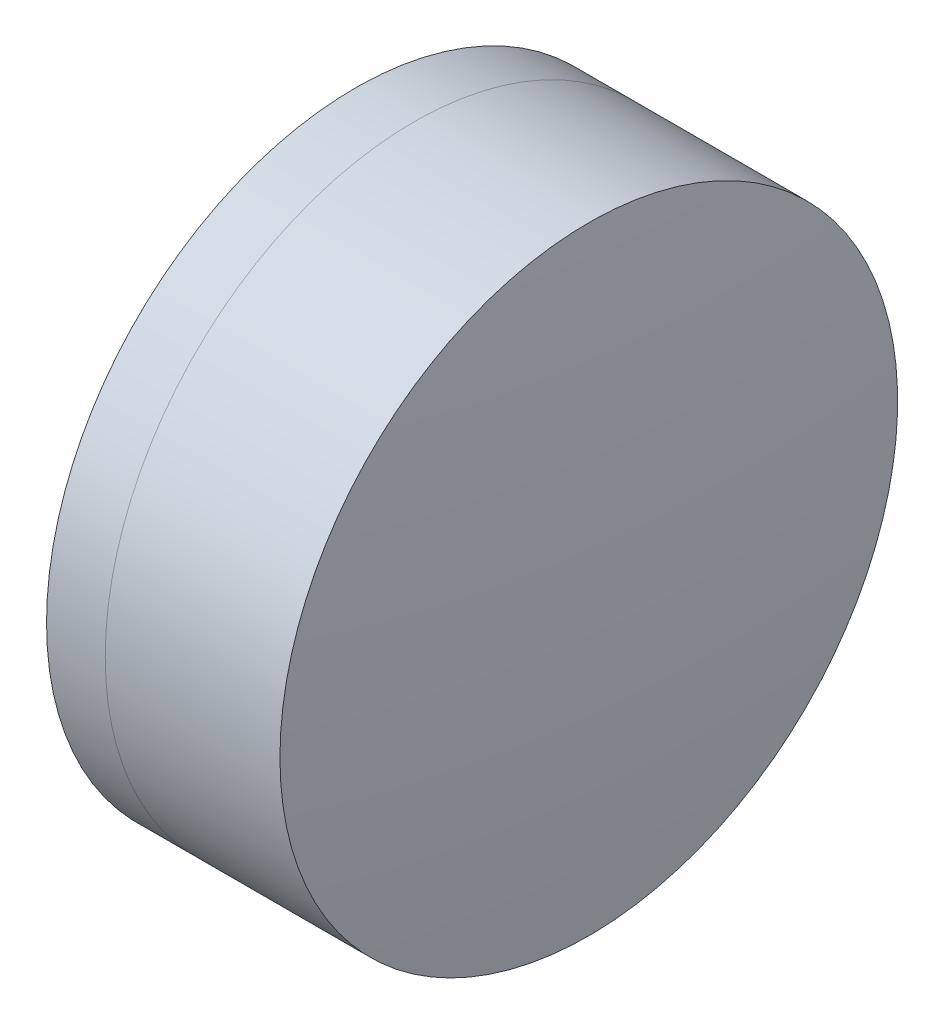
ISO-10303-21;
HEADER;
FILE_DESCRIPTION(('STEP AP214'),'2;1');
FILE_NAME('part.step','',(''),(''),'','','');
FILE_SCHEMA(('AUTOMOTIVE_DESIGN { 1 0 10303 214 1 1 1 1 }'));
ENDSEC;
DATA;
#1=APPLICATION_CONTEXT('core data for automotive mechanical design processes');
#2=APPLICATION_PROTOCOL_DEFINITION('international standard','automotive_design',2000,#1);
#3=PRODUCT_CONTEXT('',#1,'mechanical');
#4=PRODUCT('Part','Part','',(#3));
#5=PRODUCT_RELATED_PRODUCT_CATEGORY('part','',(#4));
#6=PRODUCT_DEFINITION_FORMATION('','',#4);
#7=PRODUCT_DEFINITION_CONTEXT('part definition',#1,'design');
#8=PRODUCT_DEFINITION('design','',#6,#7);
#9=PRODUCT_DEFINITION_SHAPE('','',#8);
#10=(LENGTH_UNIT() NAMED_UNIT(*) SI_UNIT(.MILLI.,.METRE.));
#11=(NAMED_UNIT(*) PLANE_ANGLE_UNIT() SI_UNIT($,.RADIAN.));
#12=(NAMED_UNIT(*) SI_UNIT($,.STERADIAN.) SOLID_ANGLE_UNIT());
#13=UNCERTAINTY_MEASURE_WITH_UNIT(LENGTH_MEASURE(1.E-05),#10,'distance_accuracy_value','');
#14=(GEOMETRIC_REPRESENTATION_CONTEXT(3) GLOBAL_UNCERTAINTY_ASSIGNED_CONTEXT((#13)) GLOBAL_UNIT_ASSIGNED_CONTEXT((#10,
#11,#12)) REPRESENTATION_CONTEXT('',''));
#15=CARTESIAN_POINT('',(0.,0.,0.));
#16=DIRECTION('',(0.,0.,1.));
#17=DIRECTION('',(1.,0.,0.));
#18=AXIS2_PLACEMENT_3D('',#15,#16,#17);
#19=CARTESIAN_POINT('',(257.503074490827,0.,0.));
#20=DIRECTION('',(-1.,0.,0.));
#21=DIRECTION('',(0.,0.,1.));
#22=AXIS2_PLACEMENT_3D('',#19,#20,#21);
#23=SPHERICAL_SURFACE('',#22,8.59999999999999);
#24=CARTESIAN_POINT('',(265.116221015097,0.,0.));
#25=DIRECTION('',(-1.,0.,0.));
#26=DIRECTION('',(0.,0.,1.));
#27=AXIS2_PLACEMENT_3D('',#24,#25,#26);
#28=CIRCLE('',#27,4.);
#29=CARTESIAN_POINT('',(265.116221015097,0.,4.));
#30=VERTEX_POINT('',#29);
#31=EDGE_CURVE('E11',#30,#30,#28,.T.);
#32=ORIENTED_EDGE('',*,*,#31,.T.);
#33=EDGE_LOOP('',(#32));
#34=FACE_BOUND('',#33,.T.);
#35=ADVANCED_FACE('F49',(#34),#23,.F.);
#36=CARTESIAN_POINT('',(-0.551919992657797,0.,0.));
#37=DIRECTION('',(-1.,0.,0.));
#38=DIRECTION('',(0.,0.,1.));
#39=AXIS2_PLACEMENT_3D('',#36,#37,#38);
#40=CYLINDRICAL_SURFACE('',#39,4.);
#41=CARTESIAN_POINT('',(267.378908985608,0.,0.));
#42=DIRECTION('',(-1.,0.,0.));
#43=DIRECTION('',(0.,0.,1.));
#44=AXIS2_PLACEMENT_3D('',#41,#42,#43);
#45=CIRCLE('',#44,4.);
#46=CARTESIAN_POINT('',(267.378908985608,0.,4.));
#47=VERTEX_POINT('',#46);
#48=EDGE_CURVE('E56',#47,#47,#45,.T.);
#49=ORIENTED_EDGE('',*,*,#48,.T.);
#50=EDGE_LOOP('',(#49));
#51=FACE_BOUND('',#50,.T.);
#52=ORIENTED_EDGE('',*,*,#31,.F.);
#53=EDGE_LOOP('',(#52));
#54=FACE_BOUND('',#53,.T.);
#55=ADVANCED_FACE('F63',(#51,#54),#40,.T.);
#56=CARTESIAN_POINT('',(231.803074490827,0.,0.));
#57=DIRECTION('',(-1.,0.,0.));
#58=DIRECTION('',(0.,0.,1.));
#59=AXIS2_PLACEMENT_3D('',#56,#57,#58);
#60=SPHERICAL_SURFACE('',#59,35.8);
#61=ORIENTED_EDGE('',*,*,#48,.F.);
#62=EDGE_LOOP('',(#61));
#63=FACE_BOUND('',#62,.T.);
#64=ADVANCED_FACE('F66',(#63),#60,.T.);
#65=CLOSED_SHELL('',(#35,#55,#64));
#66=MANIFOLD_SOLID_BREP('B2',#65);
#67=CARTESIAN_POINT('',(274.603074490827,0.,0.));
#68=DIRECTION('',(-1.,0.,0.));
#69=DIRECTION('',(0.,0.,1.));
#70=AXIS2_PLACEMENT_3D('',#67,#68,#69);
#71=SPHERICAL_SURFACE('',#70,11.);
#72=CARTESIAN_POINT('',(264.356123724868,0.,0.));
#73=DIRECTION('',(-1.,0.,0.));
#74=DIRECTION('',(0.,0.,1.));
#75=AXIS2_PLACEMENT_3D('',#72,#73,#74);
#76=CIRCLE('',#75,4.);
#77=CARTESIAN_POINT('',(264.356123724868,0.,4.));
#78=VERTEX_POINT('',#77);
#79=EDGE_CURVE('E48',#78,#78,#76,.T.);
#80=ORIENTED_EDGE('',*,*,#79,.T.);
#81=EDGE_LOOP('',(#80));
#82=FACE_BOUND('',#81,.T.);
#83=ADVANCED_FACE('F95',(#82),#71,.T.);
#84=CARTESIAN_POINT('',(124.523309526045,0.,0.));
#85=DIRECTION('',(-1.,0.,0.));
#86=DIRECTION('',(0.,0.,1.));
#87=AXIS2_PLACEMENT_3D('',#84,#85,#86);
#88=CYLINDRICAL_SURFACE('',#87,4.);
#89=CARTESIAN_POINT('',(265.116221015097,0.,0.));
#90=DIRECTION('',(-1.,0.,0.));
#91=DIRECTION('',(0.,0.,1.));
#92=AXIS2_PLACEMENT_3D('',#89,#90,#91);
#93=CIRCLE('',#92,4.);
#94=CARTESIAN_POINT('',(265.116221015097,0.,4.));
#95=VERTEX_POINT('',#94);
#96=EDGE_CURVE('E102',#95,#95,#93,.T.);
#97=ORIENTED_EDGE('',*,*,#96,.T.);
#98=EDGE_LOOP('',(#97));
#99=FACE_BOUND('',#98,.T.);
#100=ORIENTED_EDGE('',*,*,#79,.F.);
#101=EDGE_LOOP('',(#100));
#102=FACE_BOUND('',#101,.T.);
#103=ADVANCED_FACE('F109',(#99,#102),#88,.T.);
#104=CARTESIAN_POINT('',(257.503074490827,0.,0.));
#105=DIRECTION('',(-1.,0.,0.));
#106=DIRECTION('',(0.,0.,1.));
#107=AXIS2_PLACEMENT_3D('',#104,#105,#106);
#108=SPHERICAL_SURFACE('',#107,8.59999999999999);
#109=ORIENTED_EDGE('',*,*,#96,.F.);
#110=EDGE_LOOP('',(#109));
#111=FACE_BOUND('',#110,.T.);
#112=ADVANCED_FACE('F112',(#111),#108,.T.);
#113=CLOSED_SHELL('',(#83,#103,#112));
#114=MANIFOLD_SOLID_BREP('B6',#113);
#115=ADVANCED_BREP_SHAPE_REPRESENTATION('',(#18,#66,#114),#14);
#116=SHAPE_DEFINITION_REPRESENTATION(#9,#115);
ENDSEC;
END-ISO-10303-21;
